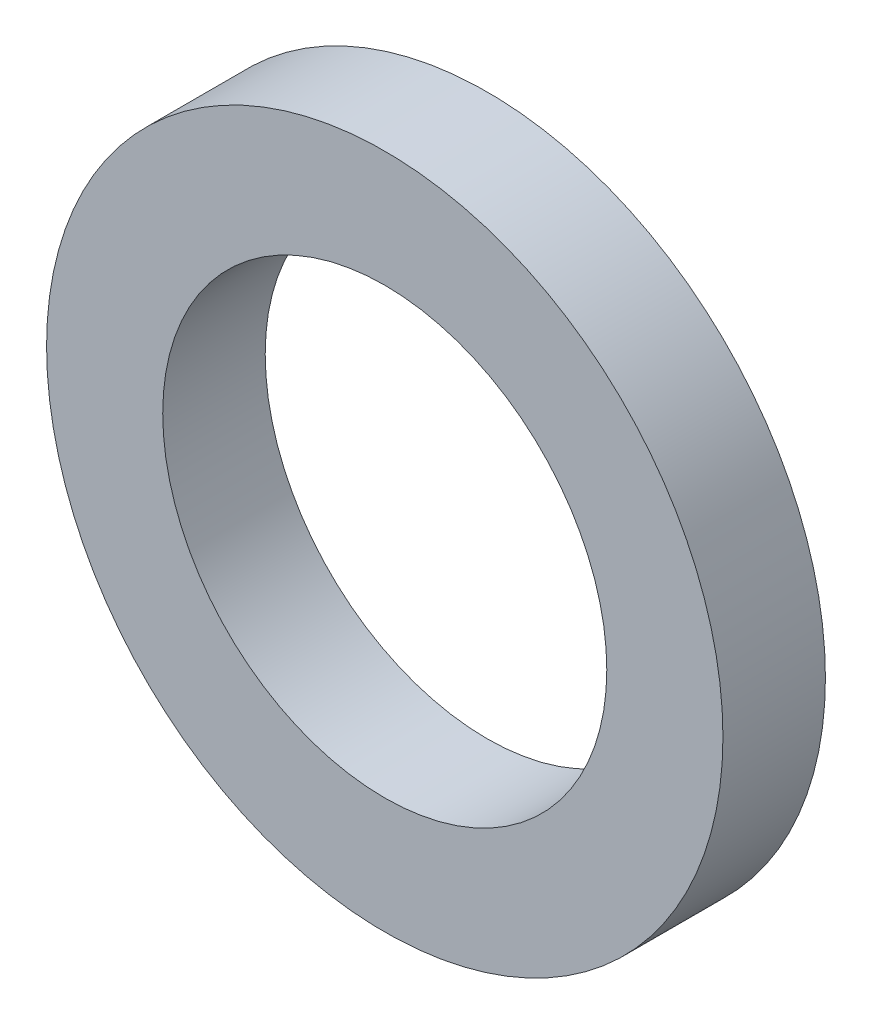
ISO-10303-21;
HEADER;
FILE_DESCRIPTION(('STEP AP214'),'2;1');
FILE_NAME('part.step','',(''),(''),'','','');
FILE_SCHEMA(('AUTOMOTIVE_DESIGN { 1 0 10303 214 1 1 1 1 }'));
ENDSEC;
DATA;
#1=APPLICATION_CONTEXT('core data for automotive mechanical design processes');
#2=APPLICATION_PROTOCOL_DEFINITION('international standard','automotive_design',2000,#1);
#3=PRODUCT_CONTEXT('',#1,'mechanical');
#4=PRODUCT('Part','Part','',(#3));
#5=PRODUCT_RELATED_PRODUCT_CATEGORY('part','',(#4));
#6=PRODUCT_DEFINITION_FORMATION('','',#4);
#7=PRODUCT_DEFINITION_CONTEXT('part definition',#1,'design');
#8=PRODUCT_DEFINITION('design','',#6,#7);
#9=PRODUCT_DEFINITION_SHAPE('','',#8);
#10=(LENGTH_UNIT() NAMED_UNIT(*) SI_UNIT(.MILLI.,.METRE.));
#11=(NAMED_UNIT(*) PLANE_ANGLE_UNIT() SI_UNIT($,.RADIAN.));
#12=(NAMED_UNIT(*) SI_UNIT($,.STERADIAN.) SOLID_ANGLE_UNIT());
#13=UNCERTAINTY_MEASURE_WITH_UNIT(LENGTH_MEASURE(1.E-05),#10,'distance_accuracy_value','');
#14=(GEOMETRIC_REPRESENTATION_CONTEXT(3) GLOBAL_UNCERTAINTY_ASSIGNED_CONTEXT((#13)) GLOBAL_UNIT_ASSIGNED_CONTEXT((#10,
#11,#12)) REPRESENTATION_CONTEXT('',''));
#15=CARTESIAN_POINT('',(0.,0.,0.));
#16=DIRECTION('',(0.,0.,1.));
#17=DIRECTION('',(1.,0.,0.));
#18=AXIS2_PLACEMENT_3D('',#15,#16,#17);
#19=CARTESIAN_POINT('',(0.,0.,1.5));
#20=DIRECTION('',(0.,0.,1.));
#21=DIRECTION('',(1.,0.,0.));
#22=AXIS2_PLACEMENT_3D('',#19,#20,#21);
#23=PLANE('',#22);
#24=CARTESIAN_POINT('',(0.,0.,1.5));
#25=DIRECTION('',(0.,0.,1.));
#26=DIRECTION('',(1.,0.,0.));
#27=AXIS2_PLACEMENT_3D('',#24,#25,#26);
#28=CIRCLE('',#27,4.95);
#29=CARTESIAN_POINT('',(4.95,0.,1.5));
#30=VERTEX_POINT('',#29);
#31=EDGE_CURVE('E10',#30,#30,#28,.T.);
#32=ORIENTED_EDGE('',*,*,#31,.T.);
#33=EDGE_LOOP('',(#32));
#34=FACE_BOUND('',#33,.T.);
#35=CARTESIAN_POINT('',(0.,0.,1.5));
#36=DIRECTION('',(0.,0.,1.));
#37=DIRECTION('',(1.,0.,0.));
#38=AXIS2_PLACEMENT_3D('',#35,#36,#37);
#39=CIRCLE('',#38,3.25);
#40=CARTESIAN_POINT('',(3.25,0.,1.5));
#41=VERTEX_POINT('',#40);
#42=EDGE_CURVE('E41',#41,#41,#39,.T.);
#43=ORIENTED_EDGE('',*,*,#42,.F.);
#44=EDGE_LOOP('',(#43));
#45=FACE_BOUND('',#44,.T.);
#46=ADVANCED_FACE('F30',(#34,#45),#23,.T.);
#47=CARTESIAN_POINT('',(0.,0.,0.));
#48=DIRECTION('',(0.,0.,1.));
#49=DIRECTION('',(1.,0.,0.));
#50=AXIS2_PLACEMENT_3D('',#47,#48,#49);
#51=PLANE('',#50);
#52=CARTESIAN_POINT('',(0.,0.,0.));
#53=DIRECTION('',(0.,0.,1.));
#54=DIRECTION('',(1.,0.,0.));
#55=AXIS2_PLACEMENT_3D('',#52,#53,#54);
#56=CIRCLE('',#55,4.95);
#57=CARTESIAN_POINT('',(4.95,0.,0.));
#58=VERTEX_POINT('',#57);
#59=EDGE_CURVE('E34',#58,#58,#56,.T.);
#60=ORIENTED_EDGE('',*,*,#59,.F.);
#61=EDGE_LOOP('',(#60));
#62=FACE_BOUND('',#61,.T.);
#63=CARTESIAN_POINT('',(0.,0.,0.));
#64=DIRECTION('',(0.,0.,1.));
#65=DIRECTION('',(1.,0.,0.));
#66=AXIS2_PLACEMENT_3D('',#63,#64,#65);
#67=CIRCLE('',#66,3.25);
#68=CARTESIAN_POINT('',(3.25,0.,0.));
#69=VERTEX_POINT('',#68);
#70=EDGE_CURVE('E43',#69,#69,#67,.T.);
#71=ORIENTED_EDGE('',*,*,#70,.T.);
#72=EDGE_LOOP('',(#71));
#73=FACE_BOUND('',#72,.T.);
#74=ADVANCED_FACE('F53',(#62,#73),#51,.F.);
#75=CARTESIAN_POINT('',(0.,0.,1.5));
#76=DIRECTION('',(0.,0.,-1.));
#77=DIRECTION('',(-1.,0.,0.));
#78=AXIS2_PLACEMENT_3D('',#75,#76,#77);
#79=CYLINDRICAL_SURFACE('',#78,4.95);
#80=ORIENTED_EDGE('',*,*,#31,.F.);
#81=EDGE_LOOP('',(#80));
#82=FACE_BOUND('',#81,.T.);
#83=ORIENTED_EDGE('',*,*,#59,.T.);
#84=EDGE_LOOP('',(#83));
#85=FACE_BOUND('',#84,.T.);
#86=ADVANCED_FACE('F32',(#82,#85),#79,.T.);
#87=CARTESIAN_POINT('',(0.,0.,1.5));
#88=DIRECTION('',(0.,0.,-1.));
#89=DIRECTION('',(-1.,0.,0.));
#90=AXIS2_PLACEMENT_3D('',#87,#88,#89);
#91=CYLINDRICAL_SURFACE('',#90,3.25);
#92=ORIENTED_EDGE('',*,*,#42,.T.);
#93=EDGE_LOOP('',(#92));
#94=FACE_BOUND('',#93,.T.);
#95=ORIENTED_EDGE('',*,*,#70,.F.);
#96=EDGE_LOOP('',(#95));
#97=FACE_BOUND('',#96,.T.);
#98=ADVANCED_FACE('F49',(#94,#97),#91,.F.);
#99=CLOSED_SHELL('',(#46,#74,#86,#98));
#100=MANIFOLD_SOLID_BREP('B2',#99);
#101=ADVANCED_BREP_SHAPE_REPRESENTATION('',(#18,#100),#14);
#102=SHAPE_DEFINITION_REPRESENTATION(#9,#101);
ENDSEC;
END-ISO-10303-21;
